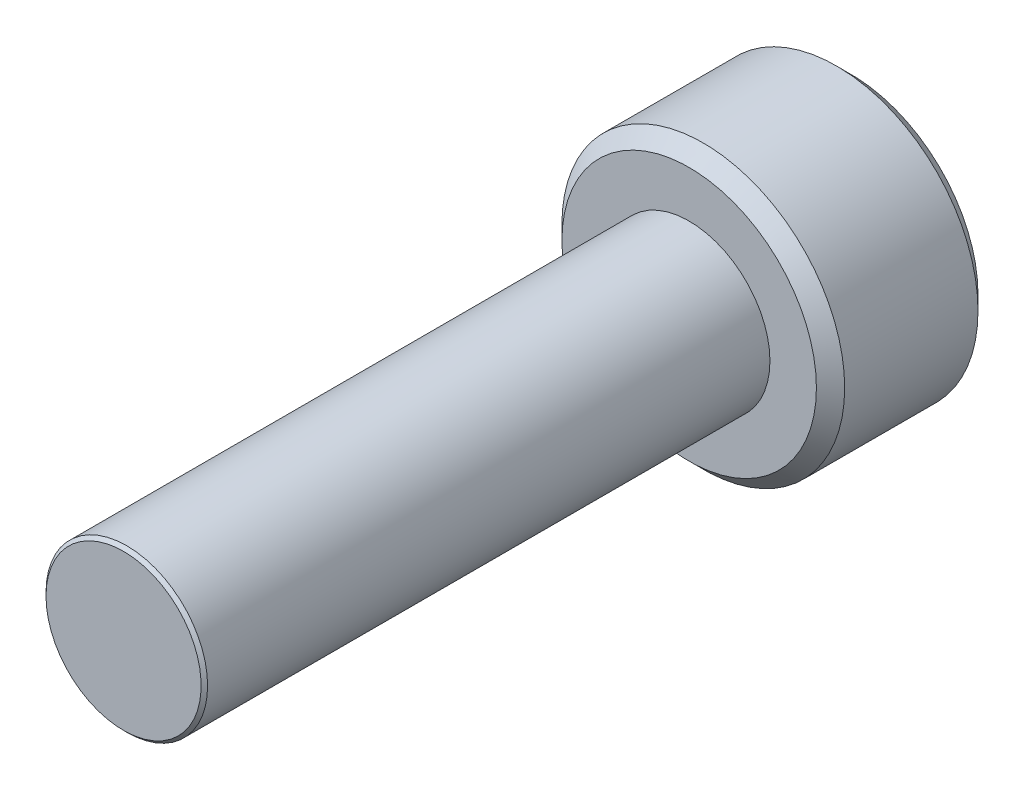
ISO-10303-21;
HEADER;
FILE_DESCRIPTION(('STEP AP214'),'2;1');
FILE_NAME('part.step','',(''),(''),'','','');
FILE_SCHEMA(('AUTOMOTIVE_DESIGN { 1 0 10303 214 1 1 1 1 }'));
ENDSEC;
DATA;
#1=APPLICATION_CONTEXT('core data for automotive mechanical design processes');
#2=APPLICATION_PROTOCOL_DEFINITION('international standard','automotive_design',2000,#1);
#3=PRODUCT_CONTEXT('',#1,'mechanical');
#4=PRODUCT('Part','Part','',(#3));
#5=PRODUCT_RELATED_PRODUCT_CATEGORY('part','',(#4));
#6=PRODUCT_DEFINITION_FORMATION('','',#4);
#7=PRODUCT_DEFINITION_CONTEXT('part definition',#1,'design');
#8=PRODUCT_DEFINITION('design','',#6,#7);
#9=PRODUCT_DEFINITION_SHAPE('','',#8);
#10=(LENGTH_UNIT() NAMED_UNIT(*) SI_UNIT(.MILLI.,.METRE.));
#11=(NAMED_UNIT(*) PLANE_ANGLE_UNIT() SI_UNIT($,.RADIAN.));
#12=(NAMED_UNIT(*) SI_UNIT($,.STERADIAN.) SOLID_ANGLE_UNIT());
#13=UNCERTAINTY_MEASURE_WITH_UNIT(LENGTH_MEASURE(1.E-05),#10,'distance_accuracy_value','');
#14=(GEOMETRIC_REPRESENTATION_CONTEXT(3) GLOBAL_UNCERTAINTY_ASSIGNED_CONTEXT((#13)) GLOBAL_UNIT_ASSIGNED_CONTEXT((#10,
#11,#12)) REPRESENTATION_CONTEXT('',''));
#15=CARTESIAN_POINT('',(0.,0.,0.));
#16=DIRECTION('',(0.,0.,1.));
#17=DIRECTION('',(1.,0.,0.));
#18=AXIS2_PLACEMENT_3D('',#15,#16,#17);
#19=CARTESIAN_POINT('',(0.,0.,-14.));
#20=DIRECTION('',(0.,0.,-1.));
#21=DIRECTION('',(-1.,0.,0.));
#22=AXIS2_PLACEMENT_3D('',#19,#20,#21);
#23=PLANE('',#22);
#24=CARTESIAN_POINT('',(0.,0.,-14.));
#25=DIRECTION('',(0.,0.,-1.));
#26=DIRECTION('',(-1.,0.,0.));
#27=AXIS2_PLACEMENT_3D('',#24,#25,#26);
#28=CIRCLE('',#27,3.15);
#29=CARTESIAN_POINT('',(-3.15,0.,-14.));
#30=VERTEX_POINT('',#29);
#31=EDGE_CURVE('E11',#30,#30,#28,.F.);
#32=ORIENTED_EDGE('',*,*,#31,.T.);
#33=EDGE_LOOP('',(#32));
#34=FACE_BOUND('',#33,.T.);
#35=CARTESIAN_POINT('',(0.,0.,-14.));
#36=DIRECTION('',(0.,0.,1.));
#37=DIRECTION('',(1.,0.,0.));
#38=AXIS2_PLACEMENT_3D('',#35,#36,#37);
#39=CIRCLE('',#38,2.);
#40=CARTESIAN_POINT('',(2.,0.,-14.));
#41=VERTEX_POINT('',#40);
#42=EDGE_CURVE('E118',#41,#41,#39,.T.);
#43=ORIENTED_EDGE('',*,*,#42,.F.);
#44=EDGE_LOOP('',(#43));
#45=FACE_BOUND('',#44,.T.);
#46=ADVANCED_FACE('F41',(#34,#45),#23,.F.);
#47=CARTESIAN_POINT('',(0.,0.,-14.));
#48=DIRECTION('',(0.,0.,1.));
#49=DIRECTION('',(1.,0.,0.));
#50=AXIS2_PLACEMENT_3D('',#47,#48,#49);
#51=CYLINDRICAL_SURFACE('',#50,2.);
#52=ORIENTED_EDGE('',*,*,#42,.T.);
#53=EDGE_LOOP('',(#52));
#54=FACE_BOUND('',#53,.T.);
#55=CARTESIAN_POINT('',(0.,0.,-0.0799999999999993));
#56=DIRECTION('',(0.,0.,1.));
#57=DIRECTION('',(1.,0.,0.));
#58=AXIS2_PLACEMENT_3D('',#55,#56,#57);
#59=CIRCLE('',#58,2.);
#60=CARTESIAN_POINT('',(-2.,0.,-0.0799999999999993));
#61=VERTEX_POINT('',#60);
#62=EDGE_CURVE('E146',#61,#61,#59,.F.);
#63=ORIENTED_EDGE('',*,*,#62,.T.);
#64=EDGE_LOOP('',(#63));
#65=FACE_BOUND('',#64,.T.);
#66=ADVANCED_FACE('F211',(#54,#65),#51,.T.);
#67=CARTESIAN_POINT('',(0.,0.,-18.));
#68=DIRECTION('',(0.,0.,1.));
#69=DIRECTION('',(1.,0.,0.));
#70=AXIS2_PLACEMENT_3D('',#67,#68,#69);
#71=CYLINDRICAL_SURFACE('',#70,3.5);
#72=CARTESIAN_POINT('',(0.,0.,-17.65));
#73=DIRECTION('',(0.,0.,-1.));
#74=DIRECTION('',(-1.,0.,0.));
#75=AXIS2_PLACEMENT_3D('',#72,#73,#74);
#76=CIRCLE('',#75,3.5);
#77=CARTESIAN_POINT('',(3.5,0.,-17.65));
#78=VERTEX_POINT('',#77);
#79=EDGE_CURVE('E50',#78,#78,#76,.F.);
#80=ORIENTED_EDGE('',*,*,#79,.T.);
#81=EDGE_LOOP('',(#80));
#82=FACE_BOUND('',#81,.T.);
#83=CARTESIAN_POINT('',(0.,0.,-14.35));
#84=DIRECTION('',(0.,0.,-1.));
#85=DIRECTION('',(-1.,0.,0.));
#86=AXIS2_PLACEMENT_3D('',#83,#84,#85);
#87=CIRCLE('',#86,3.5);
#88=CARTESIAN_POINT('',(-3.5,0.,-14.35));
#89=VERTEX_POINT('',#88);
#90=EDGE_CURVE('E190',#89,#89,#87,.T.);
#91=ORIENTED_EDGE('',*,*,#90,.T.);
#92=EDGE_LOOP('',(#91));
#93=FACE_BOUND('',#92,.T.);
#94=ADVANCED_FACE('F197',(#82,#93),#71,.T.);
#95=CARTESIAN_POINT('',(0.,0.,-18.));
#96=DIRECTION('',(0.,0.,-1.));
#97=DIRECTION('',(-1.,0.,0.));
#98=AXIS2_PLACEMENT_3D('',#95,#96,#97);
#99=PLANE('',#98);
#100=CARTESIAN_POINT('',(0.,0.,-18.));
#101=DIRECTION('',(0.,0.,-1.));
#102=DIRECTION('',(-1.,0.,0.));
#103=AXIS2_PLACEMENT_3D('',#100,#101,#102);
#104=CIRCLE('',#103,3.15);
#105=CARTESIAN_POINT('',(3.15,0.,-18.));
#106=VERTEX_POINT('',#105);
#107=EDGE_CURVE('E117',#106,#106,#104,.T.);
#108=ORIENTED_EDGE('',*,*,#107,.T.);
#109=EDGE_LOOP('',(#108));
#110=FACE_BOUND('',#109,.T.);
#111=CARTESIAN_POINT('',(0.,0.,-18.));
#112=DIRECTION('',(0.,0.,-1.));
#113=DIRECTION('',(-1.,0.,0.));
#114=AXIS2_PLACEMENT_3D('',#111,#112,#113);
#115=CIRCLE('',#114,1.73205080756888);
#116=CARTESIAN_POINT('',(-1.5,0.866025403784439,-18.));
#117=VERTEX_POINT('',#116);
#118=CARTESIAN_POINT('',(0.,1.73205080756888,-18.));
#119=VERTEX_POINT('',#118);
#120=EDGE_CURVE('E96',#117,#119,#115,.T.);
#121=ORIENTED_EDGE('',*,*,#120,.F.);
#122=CARTESIAN_POINT('',(-1.5,-0.866025403784439,-18.));
#123=VERTEX_POINT('',#122);
#124=EDGE_CURVE('E56',#123,#117,#115,.T.);
#125=ORIENTED_EDGE('',*,*,#124,.F.);
#126=CARTESIAN_POINT('',(0.,-1.73205080756888,-18.));
#127=VERTEX_POINT('',#126);
#128=EDGE_CURVE('E241',#127,#123,#115,.T.);
#129=ORIENTED_EDGE('',*,*,#128,.F.);
#130=CARTESIAN_POINT('',(1.5,-0.866025403784439,-18.));
#131=VERTEX_POINT('',#130);
#132=EDGE_CURVE('E63',#131,#127,#115,.T.);
#133=ORIENTED_EDGE('',*,*,#132,.F.);
#134=CARTESIAN_POINT('',(1.5,0.86602540378444,-18.));
#135=VERTEX_POINT('',#134);
#136=EDGE_CURVE('E141',#135,#131,#115,.T.);
#137=ORIENTED_EDGE('',*,*,#136,.F.);
#138=EDGE_CURVE('E106',#119,#135,#115,.T.);
#139=ORIENTED_EDGE('',*,*,#138,.F.);
#140=EDGE_LOOP('',(#121,#125,#129,#133,#137,#139));
#141=FACE_BOUND('',#140,.T.);
#142=ADVANCED_FACE('F140',(#110,#141),#99,.T.);
#143=CARTESIAN_POINT('',(0.,0.,-18.));
#144=DIRECTION('',(0.,0.,-1.));
#145=DIRECTION('',(-1.,0.,0.));
#146=AXIS2_PLACEMENT_3D('',#143,#144,#145);
#147=CONICAL_SURFACE('',#146,1.73205080756888,0.78539816339745);
#148=ORIENTED_EDGE('',*,*,#138,.T.);
#149=CARTESIAN_POINT('',(-0.000200000000000058,1.73216627762272,-18.0001154816001));
#150=CARTESIAN_POINT('',(0.0513677907370753,1.70239359975915,-17.9703654760673));
#151=CARTESIAN_POINT('',(0.1037979176652,1.67212305186355,-17.9423624839103));
#152=CARTESIAN_POINT('',(0.210709034055597,1.61039789003619,-17.8910892304401));
#153=CARTESIAN_POINT('',(0.265200195814661,1.57893740312614,-17.8678475050444));
#154=CARTESIAN_POINT('',(0.375079081357249,1.51549879897987,-17.8280337289922));
#155=CARTESIAN_POINT('',(0.430438809095201,1.4835368452681,-17.8113615856709));
#156=CARTESIAN_POINT('',(0.542377257477152,1.41890915196211,-17.7856744568181));
#157=CARTESIAN_POINT('',(0.59895255655301,1.38624538781118,-17.7766402904789));
#158=CARTESIAN_POINT('',(0.696455389516442,1.32995210095299,-17.7684890812269));
#159=CARTESIAN_POINT('',(0.737256908280468,1.30639533311124,-17.7672822529892));
#160=CARTESIAN_POINT('',(0.81878796961586,1.25932335290193,-17.7693140571623));
#161=CARTESIAN_POINT('',(0.859517494314631,1.23580815085313,-17.7725536707483));
#162=CARTESIAN_POINT('',(0.940584402163418,1.18900414978427,-17.783291985982));
#163=CARTESIAN_POINT('',(0.98092138459829,1.16571558211719,-17.7907946530187));
#164=CARTESIAN_POINT('',(1.06091833691403,1.11952932016335,-17.8096516119283));
#165=CARTESIAN_POINT('',(1.10057800851621,1.09663179808786,-17.8210075570186));
#166=CARTESIAN_POINT('',(1.20216313477449,1.03798159809698,-17.8547216475927));
#167=CARTESIAN_POINT('',(1.26345855370969,1.00259267147465,-17.8796218490934));
#168=CARTESIAN_POINT('',(1.35358562846331,0.950557780604374,-17.9216566532716));
#169=CARTESIAN_POINT('',(1.38328513990772,0.933410759677147,-17.9364251535591));
#170=CARTESIAN_POINT('',(1.44213790138375,0.899432101996407,-17.9673105659402));
#171=CARTESIAN_POINT('',(1.47129140422064,0.88260031928571,-17.9834268341217));
#172=CARTESIAN_POINT('',(1.5002,0.865909933730601,-18.0001154816001));
#173=B_SPLINE_CURVE_WITH_KNOTS('',3,(#149,#150,#151,#152,#153,#154,#155,#156,#157,#158,#159,
#160,#161,#162,#163,#164,#165,#166,#167,#168,#169,#170,#171,#172),.UNSPECIFIED.,.F.,.F.,(4,2,2,
2,2,2,2,2,2,2,2,4),(0.,0.199829143693305,0.40082298738239,0.598623720538183,0.795926240188891,
0.937113067959883,1.07833105577193,1.21968061668222,1.36109089931055,1.58570969637566,
1.69770705470964,1.80965120737194),.UNSPECIFIED.);
#174=EDGE_CURVE('E111',#119,#135,#173,.T.);
#175=ORIENTED_EDGE('',*,*,#174,.F.);
#176=EDGE_LOOP('',(#148,#175));
#177=FACE_BOUND('',#176,.T.);
#178=ADVANCED_FACE('F112',(#177),#147,.F.);
#179=ORIENTED_EDGE('',*,*,#136,.T.);
#180=CARTESIAN_POINT('',(1.5,-1.72720812969692,-18.5555785162708));
#181=CARTESIAN_POINT('',(1.5,-1.68515175699267,-18.5238299078574));
#182=CARTESIAN_POINT('',(1.5,-1.64286104748673,-18.4923925938074));
#183=CARTESIAN_POINT('',(1.5,-1.55771581035941,-18.4302690875564));
#184=CARTESIAN_POINT('',(1.5,-1.51486114386668,-18.3995830858922));
#185=CARTESIAN_POINT('',(1.5,-1.3846813415127,-18.3084071924272));
#186=CARTESIAN_POINT('',(1.5,-1.29637976071653,-18.2492883434268));
#187=CARTESIAN_POINT('',(1.5,-1.11121478730467,-18.1332309963165));
#188=CARTESIAN_POINT('',(1.5,-1.01415038238167,-18.076609558733));
#189=CARTESIAN_POINT('',(1.5,-0.815173408897603,-17.9730368812657));
#190=CARTESIAN_POINT('',(1.5,-0.713278669253283,-17.9260530415417));
#191=CARTESIAN_POINT('',(1.5,-0.560333774943111,-17.8685726684308));
#192=CARTESIAN_POINT('',(1.5,-0.511547982948041,-17.8520753877573));
#193=CARTESIAN_POINT('',(1.5,-0.412798620136866,-17.822997512927));
#194=CARTESIAN_POINT('',(1.5,-0.362834968437562,-17.810417188594));
#195=CARTESIAN_POINT('',(1.5,-0.262863235444982,-17.7900361941468));
#196=CARTESIAN_POINT('',(1.5,-0.212872113808022,-17.782153632746));
#197=CARTESIAN_POINT('',(1.5,-0.112355243569545,-17.771322063969));
#198=CARTESIAN_POINT('',(1.5,-0.061829588372627,-17.7683722085244));
#199=CARTESIAN_POINT('',(1.5,0.0374291733323848,-17.7676248577249));
#200=CARTESIAN_POINT('',(1.5,0.0861609672002994,-17.7696447335581));
#201=CARTESIAN_POINT('',(1.5,0.183206937768827,-17.7783225528968));
#202=CARTESIAN_POINT('',(1.5,0.231521073438269,-17.7849809469685));
#203=CARTESIAN_POINT('',(1.5,0.328199853425435,-17.8026852441226));
#204=CARTESIAN_POINT('',(1.5,0.376550616310328,-17.813805811257));
#205=CARTESIAN_POINT('',(1.5,0.472195697125599,-17.8398434140487));
#206=CARTESIAN_POINT('',(1.5,0.519490103092741,-17.8547601320409));
#207=CARTESIAN_POINT('',(1.5,0.668391282696624,-17.9073352235961));
#208=CARTESIAN_POINT('',(1.5,0.767878709508551,-17.950981287472));
#209=CARTESIAN_POINT('',(1.5,0.962179866690723,-18.0480229945931));
#210=CARTESIAN_POINT('',(1.5,1.05697519961444,-18.1014536650895));
#211=CARTESIAN_POINT('',(1.5,1.23814273533383,-18.2116858520046));
#212=CARTESIAN_POINT('',(1.5,1.3246994218129,-18.2681879206986));
#213=CARTESIAN_POINT('',(1.5,1.45222331290673,-18.3555343015787));
#214=CARTESIAN_POINT('',(1.5,1.49418091978756,-18.38495775868));
#215=CARTESIAN_POINT('',(1.5,1.57752272931476,-18.4445828218305));
#216=CARTESIAN_POINT('',(1.5,1.61890708647354,-18.4747842116644));
#217=CARTESIAN_POINT('',(1.5,1.66005278019494,-18.5053081786095));
#218=B_SPLINE_CURVE_WITH_KNOTS('',3,(#180,#181,#182,#183,#184,#185,#186,#187,#188,#189,#190,
#191,#192,#193,#194,#195,#196,#197,#198,#199,#200,#201,#202,#203,#204,#205,#206,#207,#208,#209,
#210,#211,#212,#213,#214,#215,#216,#217),.UNSPECIFIED.,.F.,.F.,(4,2,2,2,2,2,2,2,2,2,2,2,2,2,2,2,
2,2,4),(0.,0.15807954898267,0.316198780993941,0.634850417346955,0.971690311361509,
1.30737131660667,1.46173961127088,1.61611853740677,1.76772101421409,1.91929742368538,
2.065387412096,2.21149159305544,2.36014984633872,2.50879566386709,2.83376031422673,
3.15991186985651,3.46985601802197,3.62358896039973,3.7772796264207),.UNSPECIFIED.);
#219=EDGE_CURVE('E105',#135,#131,#218,.F.);
#220=ORIENTED_EDGE('',*,*,#219,.F.);
#221=EDGE_LOOP('',(#179,#220));
#222=FACE_BOUND('',#221,.T.);
#223=ADVANCED_FACE('F210',(#222),#147,.F.);
#224=ORIENTED_EDGE('',*,*,#132,.T.);
#225=CARTESIAN_POINT('',(1.5002,-0.865909933730601,-18.0001154816001));
#226=CARTESIAN_POINT('',(1.44863220926292,-0.895682611594166,-17.9703654760673));
#227=CARTESIAN_POINT('',(1.3962020823348,-0.925953159489765,-17.9423624839103));
#228=CARTESIAN_POINT('',(1.2892909659444,-0.987678321317124,-17.8910892304401));
#229=CARTESIAN_POINT('',(1.23479980418534,-1.01913880822718,-17.8678475050444));
#230=CARTESIAN_POINT('',(1.12492091864275,-1.08257741237344,-17.8280337289922));
#231=CARTESIAN_POINT('',(1.0695611909048,-1.11453936608521,-17.8113615856709));
#232=CARTESIAN_POINT('',(0.957622742522848,-1.1791670593912,-17.7856744568181));
#233=CARTESIAN_POINT('',(0.90104744344699,-1.21183082354213,-17.7766402904789));
#234=CARTESIAN_POINT('',(0.803544610483558,-1.26812411040032,-17.7684890812269));
#235=CARTESIAN_POINT('',(0.762743091719532,-1.29168087824208,-17.7672822529892));
#236=CARTESIAN_POINT('',(0.68121203038414,-1.33875285845138,-17.7693140571623));
#237=CARTESIAN_POINT('',(0.640482505685369,-1.36226806050018,-17.7725536707483));
#238=CARTESIAN_POINT('',(0.559415597836582,-1.40907206156905,-17.783291985982));
#239=CARTESIAN_POINT('',(0.51907861540171,-1.43236062923612,-17.7907946530187));
#240=CARTESIAN_POINT('',(0.439081663085967,-1.47854689118997,-17.8096516119283));
#241=CARTESIAN_POINT('',(0.39942199148379,-1.50144441326545,-17.8210075570186));
#242=CARTESIAN_POINT('',(0.297836865225514,-1.56009461325633,-17.8547216475927));
#243=CARTESIAN_POINT('',(0.236541446290309,-1.59548353987866,-17.8796218490934));
#244=CARTESIAN_POINT('',(0.146414371536685,-1.64751843074894,-17.9216566532716));
#245=CARTESIAN_POINT('',(0.116714860092282,-1.66466545167617,-17.9364251535591));
#246=CARTESIAN_POINT('',(0.0578620986162491,-1.69864410935691,-17.9673105659402));
#247=CARTESIAN_POINT('',(0.0287085957793631,-1.71547589206761,-17.9834268341217));
#248=CARTESIAN_POINT('',(-0.00019999999999949,-1.73216627762271,-18.0001154816001));
#249=B_SPLINE_CURVE_WITH_KNOTS('',3,(#225,#226,#227,#228,#229,#230,#231,#232,#233,#234,#235,
#236,#237,#238,#239,#240,#241,#242,#243,#244,#245,#246,#247,#248),.UNSPECIFIED.,.F.,.F.,(4,2,2,
2,2,2,2,2,2,2,2,4),(0.,0.199829143693305,0.40082298738239,0.598623720538183,0.795926240188891,
0.937113067959883,1.07833105577193,1.21968061668222,1.36109089931055,1.58570969637566,
1.69770705470964,1.80965120737194),.UNSPECIFIED.);
#250=EDGE_CURVE('E157',#131,#127,#249,.T.);
#251=ORIENTED_EDGE('',*,*,#250,.F.);
#252=EDGE_LOOP('',(#224,#251));
#253=FACE_BOUND('',#252,.T.);
#254=ADVANCED_FACE('F363',(#253),#147,.F.);
#255=ORIENTED_EDGE('',*,*,#128,.T.);
#256=CARTESIAN_POINT('',(0.000200000000000558,-1.73216627762272,-18.0001154816001));
#257=CARTESIAN_POINT('',(-0.0513677907370749,-1.70239359975915,-17.9703654760673));
#258=CARTESIAN_POINT('',(-0.1037979176652,-1.67212305186355,-17.9423624839103));
#259=CARTESIAN_POINT('',(-0.210709034055596,-1.61039789003619,-17.8910892304401));
#260=CARTESIAN_POINT('',(-0.265200195814661,-1.57893740312614,-17.8678475050444));
#261=CARTESIAN_POINT('',(-0.375079081357249,-1.51549879897987,-17.8280337289922));
#262=CARTESIAN_POINT('',(-0.4304388090952,-1.4835368452681,-17.8113615856709));
#263=CARTESIAN_POINT('',(-0.542377257477152,-1.41890915196211,-17.7856744568181));
#264=CARTESIAN_POINT('',(-0.59895255655301,-1.38624538781118,-17.7766402904789));
#265=CARTESIAN_POINT('',(-0.696455389516442,-1.32995210095299,-17.7684890812269));
#266=CARTESIAN_POINT('',(-0.737256908280468,-1.30639533311124,-17.7672822529892));
#267=CARTESIAN_POINT('',(-0.81878796961586,-1.25932335290193,-17.7693140571623));
#268=CARTESIAN_POINT('',(-0.859517494314631,-1.23580815085313,-17.7725536707483));
#269=CARTESIAN_POINT('',(-0.940584402163418,-1.18900414978427,-17.783291985982));
#270=CARTESIAN_POINT('',(-0.98092138459829,-1.16571558211719,-17.7907946530187));
#271=CARTESIAN_POINT('',(-1.06091833691403,-1.11952932016335,-17.8096516119283));
#272=CARTESIAN_POINT('',(-1.10057800851621,-1.09663179808786,-17.8210075570186));
#273=CARTESIAN_POINT('',(-1.20216313477449,-1.03798159809698,-17.8547216475927));
#274=CARTESIAN_POINT('',(-1.26345855370969,-1.00259267147465,-17.8796218490934));
#275=CARTESIAN_POINT('',(-1.35358562846331,-0.950557780604374,-17.9216566532716));
#276=CARTESIAN_POINT('',(-1.38328513990772,-0.933410759677147,-17.9364251535591));
#277=CARTESIAN_POINT('',(-1.44213790138375,-0.899432101996407,-17.9673105659402));
#278=CARTESIAN_POINT('',(-1.47129140422064,-0.88260031928571,-17.9834268341217));
#279=CARTESIAN_POINT('',(-1.5002,-0.865909933730601,-18.0001154816001));
#280=B_SPLINE_CURVE_WITH_KNOTS('',3,(#256,#257,#258,#259,#260,#261,#262,#263,#264,#265,#266,
#267,#268,#269,#270,#271,#272,#273,#274,#275,#276,#277,#278,#279),.UNSPECIFIED.,.F.,.F.,(4,2,2,
2,2,2,2,2,2,2,2,4),(0.,0.199829143693305,0.40082298738239,0.598623720538183,0.795926240188892,
0.937113067959884,1.07833105577193,1.21968061668222,1.36109089931055,1.58570969637566,
1.69770705470964,1.80965120737194),.UNSPECIFIED.);
#281=EDGE_CURVE('E249',#127,#123,#280,.T.);
#282=ORIENTED_EDGE('',*,*,#281,.F.);
#283=EDGE_LOOP('',(#255,#282));
#284=FACE_BOUND('',#283,.T.);
#285=ADVANCED_FACE('F247',(#284),#147,.F.);
#286=ORIENTED_EDGE('',*,*,#124,.T.);
#287=CARTESIAN_POINT('',(-1.5,-1.72720812994822,-18.5555785164605));
#288=CARTESIAN_POINT('',(-1.5,-1.68515175723692,-18.5238299080399));
#289=CARTESIAN_POINT('',(-1.5,-1.64286104772391,-18.4923925939825));
#290=CARTESIAN_POINT('',(-1.5,-1.55771581058238,-18.430269087717));
#291=CARTESIAN_POINT('',(-1.5,-1.51486114408249,-18.3995830860455));
#292=CARTESIAN_POINT('',(-1.5,-1.38468134170665,-18.3084071925586));
#293=CARTESIAN_POINT('',(-1.5,-1.29637976089561,-18.2492883435437));
#294=CARTESIAN_POINT('',(-1.5,-1.11121478745132,-18.1332309964035));
#295=CARTESIAN_POINT('',(-1.5,-1.01415038251068,-18.0766095588047));
#296=CARTESIAN_POINT('',(-1.5,-0.815173408989815,-17.9730368813091));
#297=CARTESIAN_POINT('',(-1.5,-0.713278669326361,-17.9260530415721));
#298=CARTESIAN_POINT('',(-1.5,-0.560333775001791,-17.8685726684515));
#299=CARTESIAN_POINT('',(-1.5,-0.51154798301275,-17.8520753877783));
#300=CARTESIAN_POINT('',(-1.5,-0.412798620213829,-17.8229975129476));
#301=CARTESIAN_POINT('',(-1.5,-0.362834968520752,-17.8104171886138));
#302=CARTESIAN_POINT('',(-1.5,-0.262863235540419,-17.7900361941635));
#303=CARTESIAN_POINT('',(-1.5,-0.212872113909477,-17.7821536327605));
#304=CARTESIAN_POINT('',(-1.5,-0.112355243682834,-17.7713220639777));
#305=CARTESIAN_POINT('',(-1.5,-0.0618295884917333,-17.7683722085294));
#306=CARTESIAN_POINT('',(-1.5,0.0374291732025473,-17.7676248577218));
#307=CARTESIAN_POINT('',(-1.5,0.0861609670655322,-17.7696447335505));
#308=CARTESIAN_POINT('',(-1.5,0.183206937624693,-17.7783225528794));
#309=CARTESIAN_POINT('',(-1.5,0.231521073289699,-17.7849809469459));
#310=CARTESIAN_POINT('',(-1.5,0.328199853268107,-17.802685244089));
#311=CARTESIAN_POINT('',(-1.5,0.376550616148691,-17.8138058112177));
#312=CARTESIAN_POINT('',(-1.5,0.47219569695576,-17.8398434139978));
#313=CARTESIAN_POINT('',(-1.5,0.519490102919009,-17.8547601319841));
#314=CARTESIAN_POINT('',(-1.5,0.668391282485062,-17.9073352235115));
#315=CARTESIAN_POINT('',(-1.5,0.76787870926495,-17.9509812873618));
#316=CARTESIAN_POINT('',(-1.5,0.962179866385499,-18.0480229944291));
#317=CARTESIAN_POINT('',(-1.5,1.05697519927965,-18.1014536648971));
#318=CARTESIAN_POINT('',(-1.5,1.23814273494588,-18.2116858517578));
#319=CARTESIAN_POINT('',(-1.5,1.32469942140117,-18.2681879204262));
#320=CARTESIAN_POINT('',(-1.5,1.45222331245984,-18.3555343012678));
#321=CARTESIAN_POINT('',(-1.5,1.49418091932912,-18.3849577583565));
#322=CARTESIAN_POINT('',(-1.5,1.5775227288333,-18.4445828214816));
#323=CARTESIAN_POINT('',(-1.5,1.6189070859806,-18.4747842113029));
#324=CARTESIAN_POINT('',(-1.5,1.66005277969054,-18.5053081782352));
#325=B_SPLINE_CURVE_WITH_KNOTS('',3,(#287,#288,#289,#290,#291,#292,#293,#294,#295,#296,#297,
#298,#299,#300,#301,#302,#303,#304,#305,#306,#307,#308,#309,#310,#311,#312,#313,#314,#315,#316,
#317,#318,#319,#320,#321,#322,#323,#324),.UNSPECIFIED.,.F.,.F.,(4,2,2,2,2,2,2,2,2,2,2,2,2,2,2,2,
2,2,4),(0.,0.158079549012754,0.316198781054126,0.634850417468459,0.971690311551778,
1.30737131686505,1.46173961151183,1.61611853763031,1.76772101442094,1.91929742387553,
2.06538741227088,2.21149159321503,2.36014984648184,2.50879566399376,2.83376031423511,
3.15991186974582,3.4698560178094,3.62358896013691,3.77727962610764),.UNSPECIFIED.);
#326=EDGE_CURVE('E129',#123,#117,#325,.T.);
#327=ORIENTED_EDGE('',*,*,#326,.F.);
#328=EDGE_LOOP('',(#286,#327));
#329=FACE_BOUND('',#328,.T.);
#330=ADVANCED_FACE('F350',(#329),#147,.F.);
#331=ORIENTED_EDGE('',*,*,#120,.T.);
#332=CARTESIAN_POINT('',(-1.5002,0.865909933730601,-18.0001154816001));
#333=CARTESIAN_POINT('',(-1.44863220926292,0.895682611594166,-17.9703654760673));
#334=CARTESIAN_POINT('',(-1.3962020823348,0.925953159489765,-17.9423624839103));
#335=CARTESIAN_POINT('',(-1.2892909659444,0.987678321317124,-17.8910892304401));
#336=CARTESIAN_POINT('',(-1.23479980418534,1.01913880822718,-17.8678475050444));
#337=CARTESIAN_POINT('',(-1.12492091864275,1.08257741237344,-17.8280337289922));
#338=CARTESIAN_POINT('',(-1.0695611909048,1.11453936608522,-17.8113615856709));
#339=CARTESIAN_POINT('',(-0.957622742522847,1.1791670593912,-17.7856744568181));
#340=CARTESIAN_POINT('',(-0.901047443446989,1.21183082354213,-17.7766402904789));
#341=CARTESIAN_POINT('',(-0.803544610483557,1.26812411040032,-17.7684890812269));
#342=CARTESIAN_POINT('',(-0.762743091719532,1.29168087824208,-17.7672822529892));
#343=CARTESIAN_POINT('',(-0.681212030384139,1.33875285845138,-17.7693140571623));
#344=CARTESIAN_POINT('',(-0.640482505685368,1.36226806050018,-17.7725536707483));
#345=CARTESIAN_POINT('',(-0.559415597836581,1.40907206156905,-17.783291985982));
#346=CARTESIAN_POINT('',(-0.519078615401709,1.43236062923612,-17.7907946530187));
#347=CARTESIAN_POINT('',(-0.439081663085966,1.47854689118997,-17.8096516119283));
#348=CARTESIAN_POINT('',(-0.399421991483789,1.50144441326546,-17.8210075570186));
#349=CARTESIAN_POINT('',(-0.297836865225512,1.56009461325633,-17.8547216475927));
#350=CARTESIAN_POINT('',(-0.236541446290308,1.59548353987866,-17.8796218490934));
#351=CARTESIAN_POINT('',(-0.146414371536684,1.64751843074894,-17.9216566532716));
#352=CARTESIAN_POINT('',(-0.11671486009228,1.66466545167617,-17.9364251535591));
#353=CARTESIAN_POINT('',(-0.0578620986162474,1.69864410935691,-17.9673105659402));
#354=CARTESIAN_POINT('',(-0.0287085957793618,1.71547589206761,-17.9834268341217));
#355=CARTESIAN_POINT('',(0.000200000000000437,1.73216627762272,-18.0001154816001));
#356=B_SPLINE_CURVE_WITH_KNOTS('',3,(#332,#333,#334,#335,#336,#337,#338,#339,#340,#341,#342,
#343,#344,#345,#346,#347,#348,#349,#350,#351,#352,#353,#354,#355),.UNSPECIFIED.,.F.,.F.,(4,2,2,
2,2,2,2,2,2,2,2,4),(0.,0.199829143693305,0.40082298738239,0.598623720538184,0.795926240188892,
0.937113067959884,1.07833105577193,1.21968061668222,1.36109089931055,1.58570969637566,
1.69770705470964,1.80965120737194),.UNSPECIFIED.);
#357=EDGE_CURVE('E100',#117,#119,#356,.T.);
#358=ORIENTED_EDGE('',*,*,#357,.F.);
#359=EDGE_LOOP('',(#331,#358));
#360=FACE_BOUND('',#359,.T.);
#361=ADVANCED_FACE('F98',(#360),#147,.F.);
#362=CARTESIAN_POINT('',(1.5,2.59807621135332,-15.75));
#363=DIRECTION('',(0.,0.,-1.));
#364=DIRECTION('',(-1.,0.,0.));
#365=AXIS2_PLACEMENT_3D('',#362,#363,#364);
#366=PLANE('',#365);
#367=DIRECTION('',(0.866025403784439,0.5,0.));
#368=VECTOR('',#367,1.);
#369=CARTESIAN_POINT('',(-1.5,0.866025403784439,-15.75));
#370=LINE('',#369,#368);
#371=CARTESIAN_POINT('',(-1.5,0.866025403784439,-15.75));
#372=VERTEX_POINT('',#371);
#373=CARTESIAN_POINT('',(0.,1.73205080756888,-15.75));
#374=VERTEX_POINT('',#373);
#375=EDGE_CURVE('E128',#372,#374,#370,.T.);
#376=ORIENTED_EDGE('',*,*,#375,.T.);
#377=DIRECTION('',(0.866025403784439,-0.5,0.));
#378=VECTOR('',#377,1.);
#379=CARTESIAN_POINT('',(0.,1.73205080756888,-15.75));
#380=LINE('',#379,#378);
#381=CARTESIAN_POINT('',(1.5,0.866025403784439,-15.75));
#382=VERTEX_POINT('',#381);
#383=EDGE_CURVE('E133',#374,#382,#380,.T.);
#384=ORIENTED_EDGE('',*,*,#383,.T.);
#385=DIRECTION('',(0.,-1.,0.));
#386=VECTOR('',#385,1.);
#387=CARTESIAN_POINT('',(1.5,0.866025403784439,-15.75));
#388=LINE('',#387,#386);
#389=CARTESIAN_POINT('',(1.5,-0.866025403784439,-15.75));
#390=VERTEX_POINT('',#389);
#391=EDGE_CURVE('E277',#382,#390,#388,.T.);
#392=ORIENTED_EDGE('',*,*,#391,.T.);
#393=DIRECTION('',(-0.866025403784439,-0.5,0.));
#394=VECTOR('',#393,1.);
#395=CARTESIAN_POINT('',(1.5,-0.866025403784439,-15.75));
#396=LINE('',#395,#394);
#397=CARTESIAN_POINT('',(0.,-1.73205080756888,-15.75));
#398=VERTEX_POINT('',#397);
#399=EDGE_CURVE('E280',#390,#398,#396,.T.);
#400=ORIENTED_EDGE('',*,*,#399,.T.);
#401=DIRECTION('',(-0.866025403784439,0.5,0.));
#402=VECTOR('',#401,1.);
#403=CARTESIAN_POINT('',(0.,-1.73205080756888,-15.75));
#404=LINE('',#403,#402);
#405=CARTESIAN_POINT('',(-1.5,-0.866025403784439,-15.75));
#406=VERTEX_POINT('',#405);
#407=EDGE_CURVE('E263',#398,#406,#404,.T.);
#408=ORIENTED_EDGE('',*,*,#407,.T.);
#409=DIRECTION('',(0.,1.,0.));
#410=VECTOR('',#409,1.);
#411=CARTESIAN_POINT('',(-1.5,-0.866025403784439,-15.75));
#412=LINE('',#411,#410);
#413=EDGE_CURVE('E137',#406,#372,#412,.T.);
#414=ORIENTED_EDGE('',*,*,#413,.T.);
#415=EDGE_LOOP('',(#376,#384,#392,#400,#408,#414));
#416=FACE_BOUND('',#415,.T.);
#417=ADVANCED_FACE('F178',(#416),#366,.T.);
#418=CARTESIAN_POINT('',(0.,1.73205080756888,-15.75));
#419=DIRECTION('',(0.5,0.866025403784439,0.));
#420=DIRECTION('',(-0.866025403784439,0.5,0.));
#421=AXIS2_PLACEMENT_3D('',#418,#419,#420);
#422=PLANE('',#421);
#423=DIRECTION('',(0.,0.,-1.));
#424=VECTOR('',#423,1.);
#425=CARTESIAN_POINT('',(0.,1.73205080756888,-15.75));
#426=LINE('',#425,#424);
#427=EDGE_CURVE('E124',#374,#119,#426,.T.);
#428=ORIENTED_EDGE('',*,*,#427,.T.);
#429=ORIENTED_EDGE('',*,*,#174,.T.);
#430=DIRECTION('',(0.,0.,-1.));
#431=VECTOR('',#430,1.);
#432=CARTESIAN_POINT('',(1.5,0.866025403784439,-15.75));
#433=LINE('',#432,#431);
#434=EDGE_CURVE('E136',#382,#135,#433,.T.);
#435=ORIENTED_EDGE('',*,*,#434,.F.);
#436=ORIENTED_EDGE('',*,*,#383,.F.);
#437=EDGE_LOOP('',(#428,#429,#435,#436));
#438=FACE_BOUND('',#437,.T.);
#439=ADVANCED_FACE('F131',(#438),#422,.F.);
#440=CARTESIAN_POINT('',(1.5,0.866025403784439,-15.75));
#441=DIRECTION('',(1.,0.,0.));
#442=DIRECTION('',(0.,0.,-1.));
#443=AXIS2_PLACEMENT_3D('',#440,#441,#442);
#444=PLANE('',#443);
#445=ORIENTED_EDGE('',*,*,#434,.T.);
#446=ORIENTED_EDGE('',*,*,#219,.T.);
#447=DIRECTION('',(0.,0.,-1.));
#448=VECTOR('',#447,1.);
#449=CARTESIAN_POINT('',(1.5,-0.866025403784439,-15.75));
#450=LINE('',#449,#448);
#451=EDGE_CURVE('E259',#390,#131,#450,.T.);
#452=ORIENTED_EDGE('',*,*,#451,.F.);
#453=ORIENTED_EDGE('',*,*,#391,.F.);
#454=EDGE_LOOP('',(#445,#446,#452,#453));
#455=FACE_BOUND('',#454,.T.);
#456=ADVANCED_FACE('F167',(#455),#444,.F.);
#457=CARTESIAN_POINT('',(1.5,-0.866025403784439,-15.75));
#458=DIRECTION('',(0.5,-0.866025403784439,0.));
#459=DIRECTION('',(0.866025403784439,0.5,0.));
#460=AXIS2_PLACEMENT_3D('',#457,#458,#459);
#461=PLANE('',#460);
#462=ORIENTED_EDGE('',*,*,#451,.T.);
#463=ORIENTED_EDGE('',*,*,#250,.T.);
#464=DIRECTION('',(0.,0.,-1.));
#465=VECTOR('',#464,1.);
#466=CARTESIAN_POINT('',(0.,-1.73205080756888,-15.75));
#467=LINE('',#466,#465);
#468=EDGE_CURVE('E257',#398,#127,#467,.T.);
#469=ORIENTED_EDGE('',*,*,#468,.F.);
#470=ORIENTED_EDGE('',*,*,#399,.F.);
#471=EDGE_LOOP('',(#462,#463,#469,#470));
#472=FACE_BOUND('',#471,.T.);
#473=ADVANCED_FACE('F171',(#472),#461,.F.);
#474=CARTESIAN_POINT('',(0.,-1.73205080756888,-15.75));
#475=DIRECTION('',(-0.5,-0.866025403784439,0.));
#476=DIRECTION('',(0.866025403784439,-0.5,0.));
#477=AXIS2_PLACEMENT_3D('',#474,#475,#476);
#478=PLANE('',#477);
#479=ORIENTED_EDGE('',*,*,#468,.T.);
#480=ORIENTED_EDGE('',*,*,#281,.T.);
#481=DIRECTION('',(0.,0.,-1.));
#482=VECTOR('',#481,1.);
#483=CARTESIAN_POINT('',(-1.5,-0.866025403784439,-15.75));
#484=LINE('',#483,#482);
#485=EDGE_CURVE('E266',#406,#123,#484,.T.);
#486=ORIENTED_EDGE('',*,*,#485,.F.);
#487=ORIENTED_EDGE('',*,*,#407,.F.);
#488=EDGE_LOOP('',(#479,#480,#486,#487));
#489=FACE_BOUND('',#488,.T.);
#490=ADVANCED_FACE('F261',(#489),#478,.F.);
#491=CARTESIAN_POINT('',(-1.5,-0.866025403784439,-15.75));
#492=DIRECTION('',(-1.,0.,0.));
#493=DIRECTION('',(0.,-1.,0.));
#494=AXIS2_PLACEMENT_3D('',#491,#492,#493);
#495=PLANE('',#494);
#496=ORIENTED_EDGE('',*,*,#485,.T.);
#497=ORIENTED_EDGE('',*,*,#326,.T.);
#498=DIRECTION('',(0.,0.,-1.));
#499=VECTOR('',#498,1.);
#500=CARTESIAN_POINT('',(-1.5,0.866025403784439,-15.75));
#501=LINE('',#500,#499);
#502=EDGE_CURVE('E126',#372,#117,#501,.T.);
#503=ORIENTED_EDGE('',*,*,#502,.F.);
#504=ORIENTED_EDGE('',*,*,#413,.F.);
#505=EDGE_LOOP('',(#496,#497,#503,#504));
#506=FACE_BOUND('',#505,.T.);
#507=ADVANCED_FACE('F299',(#506),#495,.F.);
#508=CARTESIAN_POINT('',(-1.5,0.866025403784439,-15.75));
#509=DIRECTION('',(-0.5,0.866025403784439,0.));
#510=DIRECTION('',(-0.866025403784439,-0.5,0.));
#511=AXIS2_PLACEMENT_3D('',#508,#509,#510);
#512=PLANE('',#511);
#513=ORIENTED_EDGE('',*,*,#502,.T.);
#514=ORIENTED_EDGE('',*,*,#357,.T.);
#515=ORIENTED_EDGE('',*,*,#427,.F.);
#516=ORIENTED_EDGE('',*,*,#375,.F.);
#517=EDGE_LOOP('',(#513,#514,#515,#516));
#518=FACE_BOUND('',#517,.T.);
#519=ADVANCED_FACE('F122',(#518),#512,.F.);
#520=CARTESIAN_POINT('',(0.,0.,-18.));
#521=DIRECTION('',(0.,0.,1.));
#522=DIRECTION('',(1.,0.,0.));
#523=AXIS2_PLACEMENT_3D('',#520,#521,#522);
#524=CONICAL_SURFACE('',#523,3.15,0.785398163397445);
#525=CARTESIAN_POINT('',(3.5,0.,-17.65));
#526=CARTESIAN_POINT('',(3.49635416666667,0.,-17.6536458333333));
#527=CARTESIAN_POINT('',(3.49270833333334,0.,-17.6572916666667));
#528=CARTESIAN_POINT('',(3.48541666666667,0.,-17.6645833333333));
#529=CARTESIAN_POINT('',(3.48177083333333,0.,-17.6682291666667));
#530=CARTESIAN_POINT('',(3.47447916666667,0.,-17.6755208333333));
#531=CARTESIAN_POINT('',(3.47083333333334,0.,-17.6791666666667));
#532=CARTESIAN_POINT('',(3.46354166666667,0.,-17.6864583333333));
#533=CARTESIAN_POINT('',(3.45989583333334,0.,-17.6901041666667));
#534=CARTESIAN_POINT('',(3.45260416666667,0.,-17.6973958333333));
#535=CARTESIAN_POINT('',(3.44895833333334,0.,-17.7010416666667));
#536=CARTESIAN_POINT('',(3.44166666666667,0.,-17.7083333333333));
#537=CARTESIAN_POINT('',(3.43802083333334,0.,-17.7119791666667));
#538=CARTESIAN_POINT('',(3.43072916666667,0.,-17.7192708333333));
#539=CARTESIAN_POINT('',(3.42708333333334,0.,-17.7229166666667));
#540=CARTESIAN_POINT('',(3.41979166666667,0.,-17.7302083333333));
#541=CARTESIAN_POINT('',(3.41614583333334,0.,-17.7338541666667));
#542=CARTESIAN_POINT('',(3.40885416666667,0.,-17.7411458333333));
#543=CARTESIAN_POINT('',(3.40520833333334,0.,-17.7447916666667));
#544=CARTESIAN_POINT('',(3.39791666666667,0.,-17.7520833333333));
#545=CARTESIAN_POINT('',(3.39427083333334,0.,-17.7557291666667));
#546=CARTESIAN_POINT('',(3.38697916666667,0.,-17.7630208333333));
#547=CARTESIAN_POINT('',(3.38333333333334,0.,-17.7666666666667));
#548=CARTESIAN_POINT('',(3.37604166666667,0.,-17.7739583333333));
#549=CARTESIAN_POINT('',(3.37239583333334,0.,-17.7776041666667));
#550=CARTESIAN_POINT('',(3.36510416666667,0.,-17.7848958333333));
#551=CARTESIAN_POINT('',(3.36145833333334,0.,-17.7885416666667));
#552=CARTESIAN_POINT('',(3.35416666666667,0.,-17.7958333333333));
#553=CARTESIAN_POINT('',(3.35052083333334,0.,-17.7994791666667));
#554=CARTESIAN_POINT('',(3.34322916666667,0.,-17.8067708333333));
#555=CARTESIAN_POINT('',(3.33958333333334,0.,-17.8104166666667));
#556=CARTESIAN_POINT('',(3.33229166666667,0.,-17.8177083333333));
#557=CARTESIAN_POINT('',(3.32864583333334,0.,-17.8213541666667));
#558=CARTESIAN_POINT('',(3.32135416666667,0.,-17.8286458333333));
#559=CARTESIAN_POINT('',(3.31770833333334,0.,-17.8322916666667));
#560=CARTESIAN_POINT('',(3.31041666666667,0.,-17.8395833333333));
#561=CARTESIAN_POINT('',(3.30677083333334,0.,-17.8432291666667));
#562=CARTESIAN_POINT('',(3.29947916666667,0.,-17.8505208333333));
#563=CARTESIAN_POINT('',(3.29583333333334,0.,-17.8541666666667));
#564=CARTESIAN_POINT('',(3.28854166666667,0.,-17.8614583333333));
#565=CARTESIAN_POINT('',(3.28489583333334,0.,-17.8651041666667));
#566=CARTESIAN_POINT('',(3.27760416666667,0.,-17.8723958333333));
#567=CARTESIAN_POINT('',(3.27395833333334,0.,-17.8760416666667));
#568=CARTESIAN_POINT('',(3.26666666666667,0.,-17.8833333333333));
#569=CARTESIAN_POINT('',(3.26302083333334,0.,-17.8869791666667));
#570=CARTESIAN_POINT('',(3.25572916666667,0.,-17.8942708333333));
#571=CARTESIAN_POINT('',(3.25208333333334,0.,-17.8979166666667));
#572=CARTESIAN_POINT('',(3.24479166666667,0.,-17.9052083333333));
#573=CARTESIAN_POINT('',(3.24114583333334,0.,-17.9088541666667));
#574=CARTESIAN_POINT('',(3.23385416666667,0.,-17.9161458333333));
#575=CARTESIAN_POINT('',(3.23020833333334,0.,-17.9197916666667));
#576=CARTESIAN_POINT('',(3.22291666666667,0.,-17.9270833333333));
#577=CARTESIAN_POINT('',(3.21927083333334,0.,-17.9307291666667));
#578=CARTESIAN_POINT('',(3.21197916666667,0.,-17.9380208333333));
#579=CARTESIAN_POINT('',(3.20833333333334,0.,-17.9416666666667));
#580=CARTESIAN_POINT('',(3.20104166666667,0.,-17.9489583333333));
#581=CARTESIAN_POINT('',(3.19739583333334,0.,-17.9526041666667));
#582=CARTESIAN_POINT('',(3.19010416666667,0.,-17.9598958333333));
#583=CARTESIAN_POINT('',(3.18645833333334,0.,-17.9635416666667));
#584=CARTESIAN_POINT('',(3.17916666666667,0.,-17.9708333333333));
#585=CARTESIAN_POINT('',(3.17552083333334,0.,-17.9744791666667));
#586=CARTESIAN_POINT('',(3.16822916666667,0.,-17.9817708333333));
#587=CARTESIAN_POINT('',(3.16458333333334,0.,-17.9854166666667));
#588=CARTESIAN_POINT('',(3.15729166666667,0.,-17.9927083333333));
#589=CARTESIAN_POINT('',(3.15364583333334,0.,-17.9963541666667));
#590=CARTESIAN_POINT('',(3.15,0.,-18.));
#591=B_SPLINE_CURVE_WITH_KNOTS('',3,(#525,#526,#527,#528,#529,#530,#531,#532,#533,#534,#535,
#536,#537,#538,#539,#540,#541,#542,#543,#544,#545,#546,#547,#548,#549,#550,#551,#552,#553,#554,
#555,#556,#557,#558,#559,#560,#561,#562,#563,#564,#565,#566,#567,#568,#569,#570,#571,#572,#573,
#574,#575,#576,#577,#578,#579,#580,#581,#582,#583,#584,#585,#586,#587,#588,#589,#590),
.UNSPECIFIED.,.F.,.F.,(4,2,2,2,2,2,2,2,2,2,2,2,2,2,2,2,2,2,2,2,2,2,2,2,2,2,2,2,2,2,2,2,4),(0.,
0.0154679608384549,0.0309359216769096,0.046403882515367,0.0618718433538216,0.0773398041922766,
0.0928077650307337,0.108275725869189,0.123743686707643,0.139211647546101,0.154679608384556,
0.17014756922301,0.185615530061468,0.201083490899922,0.216551451738377,0.232019412576834,
0.247487373415289,0.262955334253744,0.278423295092201,0.293891255930656,0.309359216769111,
0.324827177607568,0.340295138446023,0.355763099284478,0.371231060122935,0.38669902096139,
0.402166981799845,0.417634942638302,0.433102903476757,0.448570864315211,0.464038825153669,
0.479506785992123,0.494974746830581),.UNSPECIFIED.);
#592=EDGE_CURVE('BSEAM200',#78,#106,#591,.T.);
#593=ORIENTED_EDGE('',*,*,#79,.F.);
#594=ORIENTED_EDGE('',*,*,#107,.F.);
#595=ORIENTED_EDGE('',*,*,#592,.T.);
#596=ORIENTED_EDGE('',*,*,#592,.F.);
#597=EDGE_LOOP('',(#593,#595,#594,#596));
#598=FACE_BOUND('',#597,.T.);
#599=ADVANCED_FACE('F200',(#598),#524,.T.);
#600=CARTESIAN_POINT('',(0.,0.,-14.35));
#601=DIRECTION('',(0.,0.,-1.));
#602=DIRECTION('',(-1.,0.,0.));
#603=AXIS2_PLACEMENT_3D('',#600,#601,#602);
#604=CONICAL_SURFACE('',#603,3.5,0.785398163397451);
#605=ORIENTED_EDGE('',*,*,#31,.F.);
#606=EDGE_LOOP('',(#605));
#607=FACE_BOUND('',#606,.T.);
#608=ORIENTED_EDGE('',*,*,#90,.F.);
#609=EDGE_LOOP('',(#608));
#610=FACE_BOUND('',#609,.T.);
#611=ADVANCED_FACE('F43',(#607,#610),#604,.T.);
#612=CARTESIAN_POINT('',(0.,0.,0.));
#613=DIRECTION('',(0.,0.,-1.));
#614=DIRECTION('',(-1.,0.,0.));
#615=AXIS2_PLACEMENT_3D('',#612,#613,#614);
#616=CONICAL_SURFACE('',#615,1.92,0.785398163397443);
#617=CARTESIAN_POINT('',(0.,0.,0.));
#618=DIRECTION('',(0.,0.,1.));
#619=DIRECTION('',(1.,0.,0.));
#620=AXIS2_PLACEMENT_3D('',#617,#618,#619);
#621=CIRCLE('',#620,1.92);
#622=CARTESIAN_POINT('',(-1.92,0.,0.));
#623=VERTEX_POINT('',#622);
#624=EDGE_CURVE('E233',#623,#623,#621,.T.);
#625=CARTESIAN_POINT('',(-2.,0.,-0.0799999999999993));
#626=CARTESIAN_POINT('',(-1.99916666666667,0.,-0.079166666666666));
#627=CARTESIAN_POINT('',(-1.99833333333333,0.,-0.0783333333333327));
#628=CARTESIAN_POINT('',(-1.99666666666667,0.,-0.0766666666666661));
#629=CARTESIAN_POINT('',(-1.99583333333333,0.,-0.0758333333333327));
#630=CARTESIAN_POINT('',(-1.99416666666667,0.,-0.0741666666666661));
#631=CARTESIAN_POINT('',(-1.99333333333333,0.,-0.0733333333333328));
#632=CARTESIAN_POINT('',(-1.99166666666667,0.,-0.0716666666666661));
#633=CARTESIAN_POINT('',(-1.99083333333333,0.,-0.0708333333333327));
#634=CARTESIAN_POINT('',(-1.98916666666667,0.,-0.0691666666666661));
#635=CARTESIAN_POINT('',(-1.98833333333333,0.,-0.0683333333333328));
#636=CARTESIAN_POINT('',(-1.98666666666667,0.,-0.0666666666666662));
#637=CARTESIAN_POINT('',(-1.98583333333333,0.,-0.0658333333333328));
#638=CARTESIAN_POINT('',(-1.98416666666667,0.,-0.0641666666666661));
#639=CARTESIAN_POINT('',(-1.98333333333333,0.,-0.0633333333333328));
#640=CARTESIAN_POINT('',(-1.98166666666667,0.,-0.0616666666666662));
#641=CARTESIAN_POINT('',(-1.98083333333333,0.,-0.0608333333333328));
#642=CARTESIAN_POINT('',(-1.97916666666667,0.,-0.0591666666666662));
#643=CARTESIAN_POINT('',(-1.97833333333333,0.,-0.0583333333333329));
#644=CARTESIAN_POINT('',(-1.97666666666667,0.,-0.0566666666666662));
#645=CARTESIAN_POINT('',(-1.97583333333333,0.,-0.0558333333333329));
#646=CARTESIAN_POINT('',(-1.97416666666667,0.,-0.0541666666666662));
#647=CARTESIAN_POINT('',(-1.97333333333333,0.,-0.0533333333333329));
#648=CARTESIAN_POINT('',(-1.97166666666667,0.,-0.0516666666666662));
#649=CARTESIAN_POINT('',(-1.97083333333333,0.,-0.0508333333333329));
#650=CARTESIAN_POINT('',(-1.96916666666667,0.,-0.0491666666666662));
#651=CARTESIAN_POINT('',(-1.96833333333333,0.,-0.048333333333333));
#652=CARTESIAN_POINT('',(-1.96666666666667,0.,-0.0466666666666663));
#653=CARTESIAN_POINT('',(-1.96583333333333,0.,-0.045833333333333));
#654=CARTESIAN_POINT('',(-1.96416666666667,0.,-0.0441666666666663));
#655=CARTESIAN_POINT('',(-1.96333333333333,0.,-0.043333333333333));
#656=CARTESIAN_POINT('',(-1.96166666666667,0.,-0.0416666666666663));
#657=CARTESIAN_POINT('',(-1.96083333333333,0.,-0.040833333333333));
#658=CARTESIAN_POINT('',(-1.95916666666667,0.,-0.0391666666666664));
#659=CARTESIAN_POINT('',(-1.95833333333333,0.,-0.038333333333333));
#660=CARTESIAN_POINT('',(-1.95666666666667,0.,-0.0366666666666664));
#661=CARTESIAN_POINT('',(-1.95583333333333,0.,-0.035833333333333));
#662=CARTESIAN_POINT('',(-1.95416666666667,0.,-0.0341666666666664));
#663=CARTESIAN_POINT('',(-1.95333333333333,0.,-0.0333333333333331));
#664=CARTESIAN_POINT('',(-1.95166666666667,0.,-0.0316666666666664));
#665=CARTESIAN_POINT('',(-1.95083333333333,0.,-0.0308333333333331));
#666=CARTESIAN_POINT('',(-1.94916666666667,0.,-0.0291666666666664));
#667=CARTESIAN_POINT('',(-1.94833333333333,0.,-0.0283333333333331));
#668=CARTESIAN_POINT('',(-1.94666666666667,0.,-0.0266666666666664));
#669=CARTESIAN_POINT('',(-1.94583333333333,0.,-0.0258333333333331));
#670=CARTESIAN_POINT('',(-1.94416666666667,0.,-0.0241666666666665));
#671=CARTESIAN_POINT('',(-1.94333333333333,0.,-0.0233333333333332));
#672=CARTESIAN_POINT('',(-1.94166666666667,0.,-0.0216666666666665));
#673=CARTESIAN_POINT('',(-1.94083333333333,0.,-0.0208333333333332));
#674=CARTESIAN_POINT('',(-1.93916666666667,0.,-0.0191666666666665));
#675=CARTESIAN_POINT('',(-1.93833333333333,0.,-0.0183333333333332));
#676=CARTESIAN_POINT('',(-1.93666666666667,0.,-0.0166666666666665));
#677=CARTESIAN_POINT('',(-1.93583333333333,0.,-0.0158333333333332));
#678=CARTESIAN_POINT('',(-1.93416666666667,0.,-0.0141666666666665));
#679=CARTESIAN_POINT('',(-1.93333333333333,0.,-0.0133333333333332));
#680=CARTESIAN_POINT('',(-1.93166666666667,0.,-0.0116666666666666));
#681=CARTESIAN_POINT('',(-1.93083333333333,0.,-0.0108333333333333));
#682=CARTESIAN_POINT('',(-1.92916666666667,0.,-0.00916666666666658));
#683=CARTESIAN_POINT('',(-1.92833333333333,0.,-0.00833333333333324));
#684=CARTESIAN_POINT('',(-1.92666666666667,0.,-0.0066666666666666));
#685=CARTESIAN_POINT('',(-1.92583333333333,0.,-0.0058333333333333));
#686=CARTESIAN_POINT('',(-1.92416666666667,0.,-0.00416666666666666));
#687=CARTESIAN_POINT('',(-1.92333333333333,0.,-0.00333333333333332));
#688=CARTESIAN_POINT('',(-1.92166666666667,0.,-0.00166666666666664));
#689=CARTESIAN_POINT('',(-1.92083333333333,0.,-0.000833333333333302));
#690=CARTESIAN_POINT('',(-1.92,0.,0.));
#691=B_SPLINE_CURVE_WITH_KNOTS('',3,(#625,#626,#627,#628,#629,#630,#631,#632,#633,#634,#635,
#636,#637,#638,#639,#640,#641,#642,#643,#644,#645,#646,#647,#648,#649,#650,#651,#652,#653,#654,
#655,#656,#657,#658,#659,#660,#661,#662,#663,#664,#665,#666,#667,#668,#669,#670,#671,#672,#673,
#674,#675,#676,#677,#678,#679,#680,#681,#682,#683,#684,#685,#686,#687,#688,#689,#690),
.UNSPECIFIED.,.F.,.F.,(4,2,2,2,2,2,2,2,2,2,2,2,2,2,2,2,2,2,2,2,2,2,2,2,2,2,2,2,2,2,2,2,4),(0.,
0.00353553390593265,0.0070710678118653,0.010606601717798,0.0141421356237306,0.0176776695296636,
0.0212132034355962,0.0247487373415289,0.0282842712474615,0.0318198051533942,0.0353553390593268,
0.0388908729652595,0.0424264068711921,0.0459619407771251,0.0494974746830577,0.0530330085889904,
0.056568542494923,0.0601040764008557,0.0636396103067883,0.0671751442127211,0.0707106781186538,
0.0742462120245864,0.0777817459305191,0.0813172798364519,0.0848528137423845,0.0883883476483172,
0.0919238815542499,0.0954594154601827,0.0989949493661153,0.102530483272048,0.106066017177981,
0.109601551083913,0.113137084989846),.UNSPECIFIED.);
#692=EDGE_CURVE('BSEAM225',#61,#623,#691,.T.);
#693=ORIENTED_EDGE('',*,*,#62,.F.);
#694=ORIENTED_EDGE('',*,*,#624,.F.);
#695=ORIENTED_EDGE('',*,*,#692,.T.);
#696=ORIENTED_EDGE('',*,*,#692,.F.);
#697=EDGE_LOOP('',(#693,#695,#694,#696));
#698=FACE_BOUND('',#697,.T.);
#699=ADVANCED_FACE('F225',(#698),#616,.T.);
#700=CARTESIAN_POINT('',(0.,0.,0.));
#701=DIRECTION('',(0.,0.,1.));
#702=DIRECTION('',(1.,0.,0.));
#703=AXIS2_PLACEMENT_3D('',#700,#701,#702);
#704=PLANE('',#703);
#705=ORIENTED_EDGE('',*,*,#624,.T.);
#706=EDGE_LOOP('',(#705));
#707=FACE_BOUND('',#706,.T.);
#708=ADVANCED_FACE('F223',(#707),#704,.T.);
#709=CLOSED_SHELL('',(#46,#66,#94,#142,#178,#223,#254,#285,#330,#361,#417,#439,#456,#473,#490,
#507,#519,#599,#611,#699,#708));
#710=MANIFOLD_SOLID_BREP('B2',#709);
#711=ADVANCED_BREP_SHAPE_REPRESENTATION('',(#18,#710),#14);
#712=SHAPE_DEFINITION_REPRESENTATION(#9,#711);
ENDSEC;
END-ISO-10303-21;
